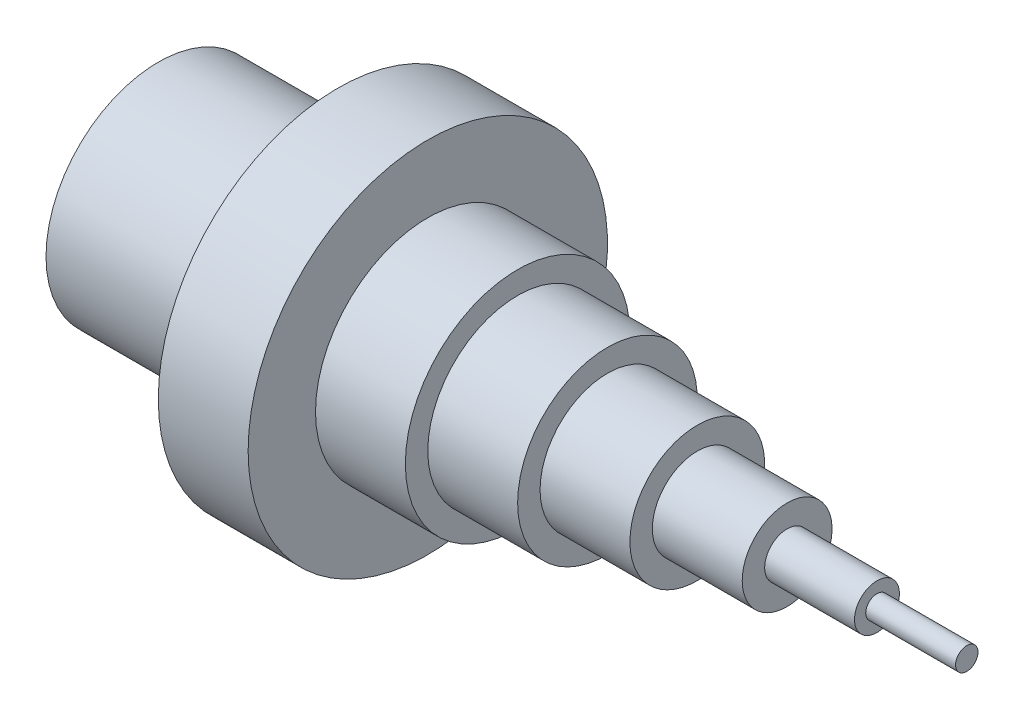
ISO-10303-21;
HEADER;
FILE_DESCRIPTION(('STEP AP214'),'2;1');
FILE_NAME('part.step','',(''),(''),'','','');
FILE_SCHEMA(('AUTOMOTIVE_DESIGN { 1 0 10303 214 1 1 1 1 }'));
ENDSEC;
DATA;
#1=APPLICATION_CONTEXT('core data for automotive mechanical design processes');
#2=APPLICATION_PROTOCOL_DEFINITION('international standard','automotive_design',2000,#1);
#3=PRODUCT_CONTEXT('',#1,'mechanical');
#4=PRODUCT('Part','Part','',(#3));
#5=PRODUCT_RELATED_PRODUCT_CATEGORY('part','',(#4));
#6=PRODUCT_DEFINITION_FORMATION('','',#4);
#7=PRODUCT_DEFINITION_CONTEXT('part definition',#1,'design');
#8=PRODUCT_DEFINITION('design','',#6,#7);
#9=PRODUCT_DEFINITION_SHAPE('','',#8);
#10=(LENGTH_UNIT() NAMED_UNIT(*) SI_UNIT(.MILLI.,.METRE.));
#11=(NAMED_UNIT(*) PLANE_ANGLE_UNIT() SI_UNIT($,.RADIAN.));
#12=(NAMED_UNIT(*) SI_UNIT($,.STERADIAN.) SOLID_ANGLE_UNIT());
#13=UNCERTAINTY_MEASURE_WITH_UNIT(LENGTH_MEASURE(1.E-05),#10,'distance_accuracy_value','');
#14=(GEOMETRIC_REPRESENTATION_CONTEXT(3) GLOBAL_UNCERTAINTY_ASSIGNED_CONTEXT((#13)) GLOBAL_UNIT_ASSIGNED_CONTEXT((#10,
#11,#12)) REPRESENTATION_CONTEXT('',''));
#15=CARTESIAN_POINT('',(0.,0.,0.));
#16=DIRECTION('',(0.,0.,1.));
#17=DIRECTION('',(1.,0.,0.));
#18=AXIS2_PLACEMENT_3D('',#15,#16,#17);
#19=CARTESIAN_POINT('',(180.,0.,0.));
#20=DIRECTION('',(1.,0.,0.));
#21=DIRECTION('',(0.,0.,-1.));
#22=AXIS2_PLACEMENT_3D('',#19,#20,#21);
#23=PLANE('',#22);
#24=CARTESIAN_POINT('',(180.,0.,0.));
#25=DIRECTION('',(-1.,0.,0.));
#26=DIRECTION('',(0.,0.,1.));
#27=AXIS2_PLACEMENT_3D('',#24,#25,#26);
#28=CIRCLE('',#27,2.5);
#29=CARTESIAN_POINT('',(180.,0.,2.5));
#30=VERTEX_POINT('',#29);
#31=EDGE_CURVE('E10',#30,#30,#28,.T.);
#32=ORIENTED_EDGE('',*,*,#31,.F.);
#33=EDGE_LOOP('',(#32));
#34=FACE_BOUND('',#33,.T.);
#35=ADVANCED_FACE('F31',(#34),#23,.T.);
#36=CARTESIAN_POINT('',(0.,0.,0.));
#37=DIRECTION('',(-1.,0.,0.));
#38=DIRECTION('',(0.,0.,1.));
#39=AXIS2_PLACEMENT_3D('',#36,#37,#38);
#40=CYLINDRICAL_SURFACE('',#39,2.5);
#41=ORIENTED_EDGE('',*,*,#31,.T.);
#42=EDGE_LOOP('',(#41));
#43=FACE_BOUND('',#42,.T.);
#44=CARTESIAN_POINT('',(160.,0.,0.));
#45=DIRECTION('',(-1.,0.,0.));
#46=DIRECTION('',(0.,0.,1.));
#47=AXIS2_PLACEMENT_3D('',#44,#45,#46);
#48=CIRCLE('',#47,2.5);
#49=CARTESIAN_POINT('',(160.,0.,2.5));
#50=VERTEX_POINT('',#49);
#51=EDGE_CURVE('E37',#50,#50,#48,.T.);
#52=ORIENTED_EDGE('',*,*,#51,.F.);
#53=EDGE_LOOP('',(#52));
#54=FACE_BOUND('',#53,.T.);
#55=ADVANCED_FACE('F119',(#43,#54),#40,.T.);
#56=CARTESIAN_POINT('',(160.,-5.,0.));
#57=DIRECTION('',(1.,0.,0.));
#58=DIRECTION('',(0.,0.,-1.));
#59=AXIS2_PLACEMENT_3D('',#56,#57,#58);
#60=PLANE('',#59);
#61=ORIENTED_EDGE('',*,*,#51,.T.);
#62=EDGE_LOOP('',(#61));
#63=FACE_BOUND('',#62,.T.);
#64=CARTESIAN_POINT('',(160.,0.,0.));
#65=DIRECTION('',(-1.,0.,0.));
#66=DIRECTION('',(0.,0.,1.));
#67=AXIS2_PLACEMENT_3D('',#64,#65,#66);
#68=CIRCLE('',#67,5.);
#69=CARTESIAN_POINT('',(160.,0.,5.));
#70=VERTEX_POINT('',#69);
#71=EDGE_CURVE('E41',#70,#70,#68,.T.);
#72=ORIENTED_EDGE('',*,*,#71,.F.);
#73=EDGE_LOOP('',(#72));
#74=FACE_BOUND('',#73,.T.);
#75=ADVANCED_FACE('F124',(#63,#74),#60,.T.);
#76=CARTESIAN_POINT('',(0.,0.,0.));
#77=DIRECTION('',(-1.,0.,0.));
#78=DIRECTION('',(0.,0.,1.));
#79=AXIS2_PLACEMENT_3D('',#76,#77,#78);
#80=CYLINDRICAL_SURFACE('',#79,5.);
#81=ORIENTED_EDGE('',*,*,#71,.T.);
#82=EDGE_LOOP('',(#81));
#83=FACE_BOUND('',#82,.T.);
#84=CARTESIAN_POINT('',(140.,0.,0.));
#85=DIRECTION('',(-1.,0.,0.));
#86=DIRECTION('',(0.,0.,1.));
#87=AXIS2_PLACEMENT_3D('',#84,#85,#86);
#88=CIRCLE('',#87,5.);
#89=CARTESIAN_POINT('',(140.,0.,5.));
#90=VERTEX_POINT('',#89);
#91=EDGE_CURVE('E45',#90,#90,#88,.T.);
#92=ORIENTED_EDGE('',*,*,#91,.F.);
#93=EDGE_LOOP('',(#92));
#94=FACE_BOUND('',#93,.T.);
#95=ADVANCED_FACE('F128',(#83,#94),#80,.T.);
#96=CARTESIAN_POINT('',(140.,-10.,0.));
#97=DIRECTION('',(1.,0.,0.));
#98=DIRECTION('',(0.,0.,-1.));
#99=AXIS2_PLACEMENT_3D('',#96,#97,#98);
#100=PLANE('',#99);
#101=ORIENTED_EDGE('',*,*,#91,.T.);
#102=EDGE_LOOP('',(#101));
#103=FACE_BOUND('',#102,.T.);
#104=CARTESIAN_POINT('',(140.,0.,0.));
#105=DIRECTION('',(-1.,0.,0.));
#106=DIRECTION('',(0.,0.,1.));
#107=AXIS2_PLACEMENT_3D('',#104,#105,#106);
#108=CIRCLE('',#107,10.);
#109=CARTESIAN_POINT('',(140.,0.,10.));
#110=VERTEX_POINT('',#109);
#111=EDGE_CURVE('E50',#110,#110,#108,.T.);
#112=ORIENTED_EDGE('',*,*,#111,.F.);
#113=EDGE_LOOP('',(#112));
#114=FACE_BOUND('',#113,.T.);
#115=ADVANCED_FACE('F134',(#103,#114),#100,.T.);
#116=CARTESIAN_POINT('',(0.,0.,0.));
#117=DIRECTION('',(-1.,0.,0.));
#118=DIRECTION('',(0.,0.,1.));
#119=AXIS2_PLACEMENT_3D('',#116,#117,#118);
#120=CYLINDRICAL_SURFACE('',#119,10.);
#121=ORIENTED_EDGE('',*,*,#111,.T.);
#122=EDGE_LOOP('',(#121));
#123=FACE_BOUND('',#122,.T.);
#124=CARTESIAN_POINT('',(120.,0.,0.));
#125=DIRECTION('',(-1.,0.,0.));
#126=DIRECTION('',(0.,0.,1.));
#127=AXIS2_PLACEMENT_3D('',#124,#125,#126);
#128=CIRCLE('',#127,10.);
#129=CARTESIAN_POINT('',(120.,0.,10.));
#130=VERTEX_POINT('',#129);
#131=EDGE_CURVE('E53',#130,#130,#128,.T.);
#132=ORIENTED_EDGE('',*,*,#131,.F.);
#133=EDGE_LOOP('',(#132));
#134=FACE_BOUND('',#133,.T.);
#135=ADVANCED_FACE('F138',(#123,#134),#120,.T.);
#136=CARTESIAN_POINT('',(120.,-15.,0.));
#137=DIRECTION('',(1.,0.,0.));
#138=DIRECTION('',(0.,0.,-1.));
#139=AXIS2_PLACEMENT_3D('',#136,#137,#138);
#140=PLANE('',#139);
#141=ORIENTED_EDGE('',*,*,#131,.T.);
#142=EDGE_LOOP('',(#141));
#143=FACE_BOUND('',#142,.T.);
#144=CARTESIAN_POINT('',(120.,0.,0.));
#145=DIRECTION('',(-1.,0.,0.));
#146=DIRECTION('',(0.,0.,1.));
#147=AXIS2_PLACEMENT_3D('',#144,#145,#146);
#148=CIRCLE('',#147,15.);
#149=CARTESIAN_POINT('',(120.,0.,15.));
#150=VERTEX_POINT('',#149);
#151=EDGE_CURVE('E56',#150,#150,#148,.T.);
#152=ORIENTED_EDGE('',*,*,#151,.F.);
#153=EDGE_LOOP('',(#152));
#154=FACE_BOUND('',#153,.T.);
#155=ADVANCED_FACE('F142',(#143,#154),#140,.T.);
#156=CARTESIAN_POINT('',(0.,0.,0.));
#157=DIRECTION('',(-1.,0.,0.));
#158=DIRECTION('',(0.,0.,1.));
#159=AXIS2_PLACEMENT_3D('',#156,#157,#158);
#160=CYLINDRICAL_SURFACE('',#159,15.);
#161=ORIENTED_EDGE('',*,*,#151,.T.);
#162=EDGE_LOOP('',(#161));
#163=FACE_BOUND('',#162,.T.);
#164=CARTESIAN_POINT('',(100.,0.,0.));
#165=DIRECTION('',(-1.,0.,0.));
#166=DIRECTION('',(0.,0.,1.));
#167=AXIS2_PLACEMENT_3D('',#164,#165,#166);
#168=CIRCLE('',#167,15.);
#169=CARTESIAN_POINT('',(100.,0.,15.));
#170=VERTEX_POINT('',#169);
#171=EDGE_CURVE('E59',#170,#170,#168,.T.);
#172=ORIENTED_EDGE('',*,*,#171,.F.);
#173=EDGE_LOOP('',(#172));
#174=FACE_BOUND('',#173,.T.);
#175=ADVANCED_FACE('F146',(#163,#174),#160,.T.);
#176=CARTESIAN_POINT('',(100.,-20.,0.));
#177=DIRECTION('',(1.,0.,0.));
#178=DIRECTION('',(0.,0.,-1.));
#179=AXIS2_PLACEMENT_3D('',#176,#177,#178);
#180=PLANE('',#179);
#181=ORIENTED_EDGE('',*,*,#171,.T.);
#182=EDGE_LOOP('',(#181));
#183=FACE_BOUND('',#182,.T.);
#184=CARTESIAN_POINT('',(100.,0.,0.));
#185=DIRECTION('',(-1.,0.,0.));
#186=DIRECTION('',(0.,0.,1.));
#187=AXIS2_PLACEMENT_3D('',#184,#185,#186);
#188=CIRCLE('',#187,20.);
#189=CARTESIAN_POINT('',(100.,0.,20.));
#190=VERTEX_POINT('',#189);
#191=EDGE_CURVE('E62',#190,#190,#188,.T.);
#192=ORIENTED_EDGE('',*,*,#191,.F.);
#193=EDGE_LOOP('',(#192));
#194=FACE_BOUND('',#193,.T.);
#195=ADVANCED_FACE('F150',(#183,#194),#180,.T.);
#196=CARTESIAN_POINT('',(0.,0.,0.));
#197=DIRECTION('',(-1.,0.,0.));
#198=DIRECTION('',(0.,0.,1.));
#199=AXIS2_PLACEMENT_3D('',#196,#197,#198);
#200=CYLINDRICAL_SURFACE('',#199,20.);
#201=ORIENTED_EDGE('',*,*,#191,.T.);
#202=EDGE_LOOP('',(#201));
#203=FACE_BOUND('',#202,.T.);
#204=CARTESIAN_POINT('',(80.,0.,0.));
#205=DIRECTION('',(-1.,0.,0.));
#206=DIRECTION('',(0.,0.,1.));
#207=AXIS2_PLACEMENT_3D('',#204,#205,#206);
#208=CIRCLE('',#207,20.);
#209=CARTESIAN_POINT('',(80.,0.,20.));
#210=VERTEX_POINT('',#209);
#211=EDGE_CURVE('E65',#210,#210,#208,.T.);
#212=ORIENTED_EDGE('',*,*,#211,.F.);
#213=EDGE_LOOP('',(#212));
#214=FACE_BOUND('',#213,.T.);
#215=ADVANCED_FACE('F154',(#203,#214),#200,.T.);
#216=CARTESIAN_POINT('',(80.,-25.,0.));
#217=DIRECTION('',(1.,0.,0.));
#218=DIRECTION('',(0.,0.,-1.));
#219=AXIS2_PLACEMENT_3D('',#216,#217,#218);
#220=PLANE('',#219);
#221=ORIENTED_EDGE('',*,*,#211,.T.);
#222=EDGE_LOOP('',(#221));
#223=FACE_BOUND('',#222,.T.);
#224=CARTESIAN_POINT('',(80.,0.,0.));
#225=DIRECTION('',(-1.,0.,0.));
#226=DIRECTION('',(0.,0.,1.));
#227=AXIS2_PLACEMENT_3D('',#224,#225,#226);
#228=CIRCLE('',#227,25.);
#229=CARTESIAN_POINT('',(80.,0.,25.));
#230=VERTEX_POINT('',#229);
#231=EDGE_CURVE('E68',#230,#230,#228,.T.);
#232=ORIENTED_EDGE('',*,*,#231,.F.);
#233=EDGE_LOOP('',(#232));
#234=FACE_BOUND('',#233,.T.);
#235=ADVANCED_FACE('F158',(#223,#234),#220,.T.);
#236=CARTESIAN_POINT('',(0.,0.,0.));
#237=DIRECTION('',(-1.,0.,0.));
#238=DIRECTION('',(0.,0.,1.));
#239=AXIS2_PLACEMENT_3D('',#236,#237,#238);
#240=CYLINDRICAL_SURFACE('',#239,25.);
#241=ORIENTED_EDGE('',*,*,#231,.T.);
#242=EDGE_LOOP('',(#241));
#243=FACE_BOUND('',#242,.T.);
#244=CARTESIAN_POINT('',(60.,0.,0.));
#245=DIRECTION('',(-1.,0.,0.));
#246=DIRECTION('',(0.,0.,1.));
#247=AXIS2_PLACEMENT_3D('',#244,#245,#246);
#248=CIRCLE('',#247,25.);
#249=CARTESIAN_POINT('',(60.,0.,25.));
#250=VERTEX_POINT('',#249);
#251=EDGE_CURVE('E71',#250,#250,#248,.T.);
#252=ORIENTED_EDGE('',*,*,#251,.F.);
#253=EDGE_LOOP('',(#252));
#254=FACE_BOUND('',#253,.T.);
#255=ADVANCED_FACE('F162',(#243,#254),#240,.T.);
#256=CARTESIAN_POINT('',(60.,-40.,0.));
#257=DIRECTION('',(1.,0.,0.));
#258=DIRECTION('',(0.,0.,-1.));
#259=AXIS2_PLACEMENT_3D('',#256,#257,#258);
#260=PLANE('',#259);
#261=ORIENTED_EDGE('',*,*,#251,.T.);
#262=EDGE_LOOP('',(#261));
#263=FACE_BOUND('',#262,.T.);
#264=CARTESIAN_POINT('',(60.,0.,0.));
#265=DIRECTION('',(-1.,0.,0.));
#266=DIRECTION('',(0.,0.,1.));
#267=AXIS2_PLACEMENT_3D('',#264,#265,#266);
#268=CIRCLE('',#267,40.);
#269=CARTESIAN_POINT('',(60.,0.,40.));
#270=VERTEX_POINT('',#269);
#271=EDGE_CURVE('E74',#270,#270,#268,.T.);
#272=ORIENTED_EDGE('',*,*,#271,.F.);
#273=EDGE_LOOP('',(#272));
#274=FACE_BOUND('',#273,.T.);
#275=ADVANCED_FACE('F166',(#263,#274),#260,.T.);
#276=CARTESIAN_POINT('',(0.,0.,0.));
#277=DIRECTION('',(-1.,0.,0.));
#278=DIRECTION('',(0.,0.,1.));
#279=AXIS2_PLACEMENT_3D('',#276,#277,#278);
#280=CYLINDRICAL_SURFACE('',#279,40.);
#281=ORIENTED_EDGE('',*,*,#271,.T.);
#282=EDGE_LOOP('',(#281));
#283=FACE_BOUND('',#282,.T.);
#284=CARTESIAN_POINT('',(40.,0.,0.));
#285=DIRECTION('',(-1.,0.,0.));
#286=DIRECTION('',(0.,0.,1.));
#287=AXIS2_PLACEMENT_3D('',#284,#285,#286);
#288=CIRCLE('',#287,40.);
#289=CARTESIAN_POINT('',(40.,0.,40.));
#290=VERTEX_POINT('',#289);
#291=EDGE_CURVE('E77',#290,#290,#288,.T.);
#292=ORIENTED_EDGE('',*,*,#291,.F.);
#293=EDGE_LOOP('',(#292));
#294=FACE_BOUND('',#293,.T.);
#295=ADVANCED_FACE('F115',(#283,#294),#280,.T.);
#296=CARTESIAN_POINT('',(40.,-25.,0.));
#297=DIRECTION('',(-1.,0.,0.));
#298=DIRECTION('',(0.,0.,1.));
#299=AXIS2_PLACEMENT_3D('',#296,#297,#298);
#300=PLANE('',#299);
#301=ORIENTED_EDGE('',*,*,#291,.T.);
#302=EDGE_LOOP('',(#301));
#303=FACE_BOUND('',#302,.T.);
#304=CARTESIAN_POINT('',(40.,0.,0.));
#305=DIRECTION('',(-1.,0.,0.));
#306=DIRECTION('',(0.,0.,1.));
#307=AXIS2_PLACEMENT_3D('',#304,#305,#306);
#308=CIRCLE('',#307,25.);
#309=CARTESIAN_POINT('',(40.,0.,25.));
#310=VERTEX_POINT('',#309);
#311=EDGE_CURVE('E80',#310,#310,#308,.T.);
#312=ORIENTED_EDGE('',*,*,#311,.F.);
#313=EDGE_LOOP('',(#312));
#314=FACE_BOUND('',#313,.T.);
#315=ADVANCED_FACE('F109',(#303,#314),#300,.T.);
#316=CARTESIAN_POINT('',(0.,0.,0.));
#317=DIRECTION('',(-1.,0.,0.));
#318=DIRECTION('',(0.,0.,1.));
#319=AXIS2_PLACEMENT_3D('',#316,#317,#318);
#320=CYLINDRICAL_SURFACE('',#319,25.);
#321=ORIENTED_EDGE('',*,*,#311,.T.);
#322=EDGE_LOOP('',(#321));
#323=FACE_BOUND('',#322,.T.);
#324=CARTESIAN_POINT('',(0.,0.,0.));
#325=DIRECTION('',(-1.,0.,0.));
#326=DIRECTION('',(0.,0.,1.));
#327=AXIS2_PLACEMENT_3D('',#324,#325,#326);
#328=CIRCLE('',#327,25.);
#329=CARTESIAN_POINT('',(0.,0.,25.));
#330=VERTEX_POINT('',#329);
#331=EDGE_CURVE('E83',#330,#330,#328,.T.);
#332=ORIENTED_EDGE('',*,*,#331,.F.);
#333=EDGE_LOOP('',(#332));
#334=FACE_BOUND('',#333,.T.);
#335=ADVANCED_FACE('F104',(#323,#334),#320,.T.);
#336=CARTESIAN_POINT('',(0.,0.,0.));
#337=DIRECTION('',(-1.,0.,0.));
#338=DIRECTION('',(0.,0.,1.));
#339=AXIS2_PLACEMENT_3D('',#336,#337,#338);
#340=PLANE('',#339);
#341=CARTESIAN_POINT('',(0.,0.,0.));
#342=DIRECTION('',(-1.,0.,0.));
#343=DIRECTION('',(0.,0.,1.));
#344=AXIS2_PLACEMENT_3D('',#341,#342,#343);
#345=CIRCLE('',#344,20.);
#346=CARTESIAN_POINT('',(0.,0.,20.));
#347=VERTEX_POINT('',#346);
#348=EDGE_CURVE('E87',#347,#347,#345,.T.);
#349=ORIENTED_EDGE('',*,*,#348,.F.);
#350=EDGE_LOOP('',(#349));
#351=FACE_BOUND('',#350,.T.);
#352=ORIENTED_EDGE('',*,*,#331,.T.);
#353=EDGE_LOOP('',(#352));
#354=FACE_BOUND('',#353,.T.);
#355=ADVANCED_FACE('F98',(#351,#354),#340,.T.);
#356=CARTESIAN_POINT('',(40.,0.,0.));
#357=DIRECTION('',(-1.,0.,0.));
#358=DIRECTION('',(0.,0.,1.));
#359=AXIS2_PLACEMENT_3D('',#356,#357,#358);
#360=CYLINDRICAL_SURFACE('',#359,20.);
#361=CARTESIAN_POINT('',(40.,0.,0.));
#362=DIRECTION('',(-1.,0.,0.));
#363=DIRECTION('',(0.,0.,1.));
#364=AXIS2_PLACEMENT_3D('',#361,#362,#363);
#365=CIRCLE('',#364,20.);
#366=CARTESIAN_POINT('',(40.,0.,20.));
#367=VERTEX_POINT('',#366);
#368=EDGE_CURVE('E86',#367,#367,#365,.T.);
#369=ORIENTED_EDGE('',*,*,#368,.F.);
#370=EDGE_LOOP('',(#369));
#371=FACE_BOUND('',#370,.T.);
#372=ORIENTED_EDGE('',*,*,#348,.T.);
#373=EDGE_LOOP('',(#372));
#374=FACE_BOUND('',#373,.T.);
#375=ADVANCED_FACE('F95',(#371,#374),#360,.F.);
#376=CARTESIAN_POINT('',(40.,0.,0.));
#377=DIRECTION('',(-1.,0.,0.));
#378=DIRECTION('',(0.,0.,1.));
#379=AXIS2_PLACEMENT_3D('',#376,#377,#378);
#380=PLANE('',#379);
#381=ORIENTED_EDGE('',*,*,#368,.T.);
#382=EDGE_LOOP('',(#381));
#383=FACE_BOUND('',#382,.T.);
#384=ADVANCED_FACE('F93',(#383),#380,.T.);
#385=CLOSED_SHELL('',(#35,#55,#75,#95,#115,#135,#155,#175,#195,#215,#235,#255,#275,#295,#315,
#335,#355,#375,#384));
#386=MANIFOLD_SOLID_BREP('B2',#385);
#387=ADVANCED_BREP_SHAPE_REPRESENTATION('',(#18,#386),#14);
#388=SHAPE_DEFINITION_REPRESENTATION(#9,#387);
ENDSEC;
END-ISO-10303-21;
